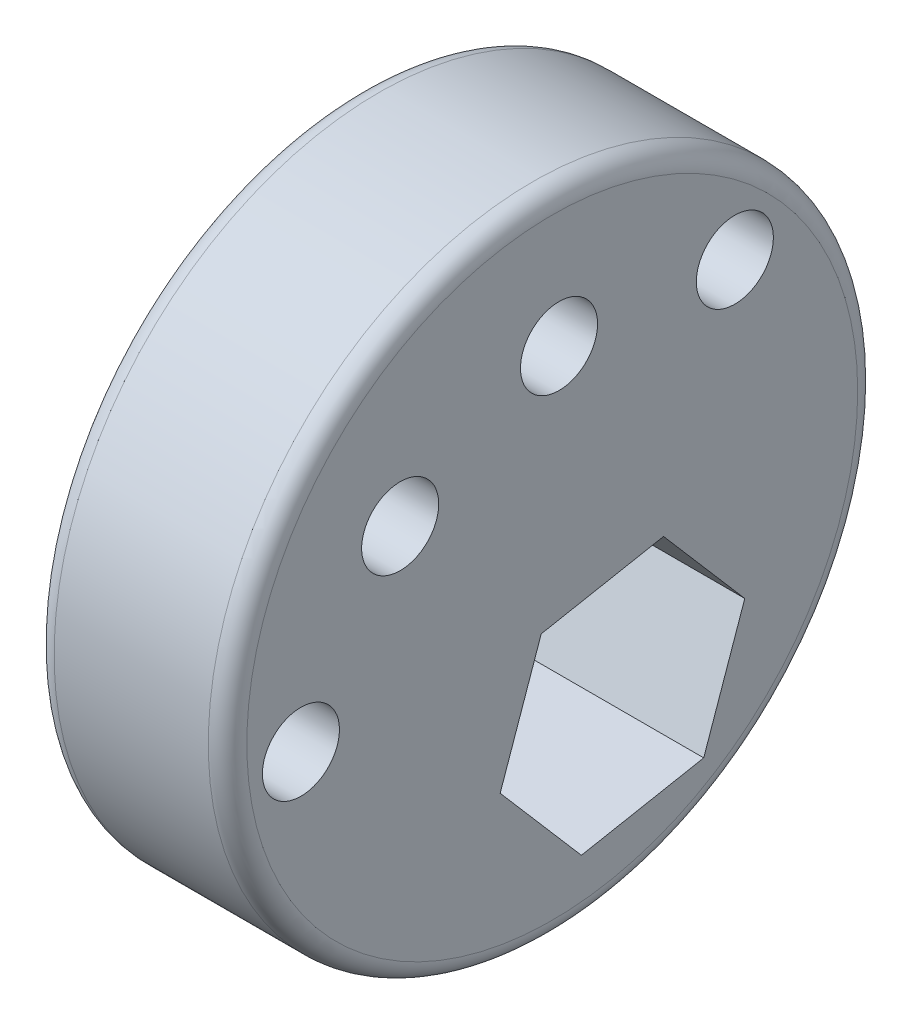
ISO-10303-21;
HEADER;
FILE_DESCRIPTION(('STEP AP214'),'2;1');
FILE_NAME('part.step','',(''),(''),'','','');
FILE_SCHEMA(('AUTOMOTIVE_DESIGN { 1 0 10303 214 1 1 1 1 }'));
ENDSEC;
DATA;
#1=APPLICATION_CONTEXT('core data for automotive mechanical design processes');
#2=APPLICATION_PROTOCOL_DEFINITION('international standard','automotive_design',2000,#1);
#3=PRODUCT_CONTEXT('',#1,'mechanical');
#4=PRODUCT('Part','Part','',(#3));
#5=PRODUCT_RELATED_PRODUCT_CATEGORY('part','',(#4));
#6=PRODUCT_DEFINITION_FORMATION('','',#4);
#7=PRODUCT_DEFINITION_CONTEXT('part definition',#1,'design');
#8=PRODUCT_DEFINITION('design','',#6,#7);
#9=PRODUCT_DEFINITION_SHAPE('','',#8);
#10=(LENGTH_UNIT() NAMED_UNIT(*) SI_UNIT(.MILLI.,.METRE.));
#11=(NAMED_UNIT(*) PLANE_ANGLE_UNIT() SI_UNIT($,.RADIAN.));
#12=(NAMED_UNIT(*) SI_UNIT($,.STERADIAN.) SOLID_ANGLE_UNIT());
#13=UNCERTAINTY_MEASURE_WITH_UNIT(LENGTH_MEASURE(1.E-05),#10,'distance_accuracy_value','');
#14=(GEOMETRIC_REPRESENTATION_CONTEXT(3) GLOBAL_UNCERTAINTY_ASSIGNED_CONTEXT((#13)) GLOBAL_UNIT_ASSIGNED_CONTEXT((#10,
#11,#12)) REPRESENTATION_CONTEXT('',''));
#15=CARTESIAN_POINT('',(0.,0.,0.));
#16=DIRECTION('',(0.,0.,1.));
#17=DIRECTION('',(1.,0.,0.));
#18=AXIS2_PLACEMENT_3D('',#15,#16,#17);
#19=CARTESIAN_POINT('',(5.,0.,0.));
#20=DIRECTION('',(1.,0.,0.));
#21=DIRECTION('',(0.,0.,-1.));
#22=AXIS2_PLACEMENT_3D('',#19,#20,#21);
#23=PLANE('',#22);
#24=CARTESIAN_POINT('',(5.,0.,0.));
#25=DIRECTION('',(1.,0.,0.));
#26=DIRECTION('',(0.,0.,-1.));
#27=AXIS2_PLACEMENT_3D('',#24,#25,#26);
#28=CIRCLE('',#27,7.925);
#29=CARTESIAN_POINT('',(5.,0.,-7.925));
#30=VERTEX_POINT('',#29);
#31=EDGE_CURVE('E128',#30,#30,#28,.T.);
#32=ORIENTED_EDGE('',*,*,#31,.T.);
#33=EDGE_LOOP('',(#32));
#34=FACE_BOUND('',#33,.T.);
#35=CARTESIAN_POINT('',(5.,2.9036531502851,3.94577731481241));
#36=DIRECTION('',(1.,0.,0.));
#37=DIRECTION('',(0.,0.,-1.));
#38=AXIS2_PLACEMENT_3D('',#35,#36,#37);
#39=CIRCLE('',#38,1.);
#40=CARTESIAN_POINT('',(5.,2.9036531502851,2.94577731481241));
#41=VERTEX_POINT('',#40);
#42=EDGE_CURVE('E213',#41,#41,#39,.T.);
#43=ORIENTED_EDGE('',*,*,#42,.F.);
#44=EDGE_LOOP('',(#43));
#45=FACE_BOUND('',#44,.T.);
#46=CARTESIAN_POINT('',(5.,4.55040375200198,-4.73716011742074));
#47=DIRECTION('',(1.,0.,0.));
#48=DIRECTION('',(0.,0.,-1.));
#49=AXIS2_PLACEMENT_3D('',#46,#47,#48);
#50=CIRCLE('',#49,1.);
#51=CARTESIAN_POINT('',(5.,4.55040375200198,-5.73716011742074));
#52=VERTEX_POINT('',#51);
#53=EDGE_CURVE('E127',#52,#52,#50,.T.);
#54=ORIENTED_EDGE('',*,*,#53,.F.);
#55=EDGE_LOOP('',(#54));
#56=FACE_BOUND('',#55,.T.);
#57=DIRECTION('',(0.,-0.757692435093475,-0.652611809425879));
#58=VECTOR('',#57,1.);
#59=CARTESIAN_POINT('',(5.,-6.84181547796235,-0.756323030851715));
#60=LINE('',#59,#58);
#61=CARTESIAN_POINT('',(5.,-4.39446891261044,1.35161311359386));
#62=VERTEX_POINT('',#61);
#63=CARTESIAN_POINT('',(5.,-6.84181547796235,-0.756323030851715));
#64=VERTEX_POINT('',#63);
#65=EDGE_CURVE('E90',#62,#64,#60,.T.);
#66=ORIENTED_EDGE('',*,*,#65,.F.);
#67=DIRECTION('',(0.,-0.944024623319282,0.329874992333289));
#68=VECTOR('',#67,1.);
#69=CARTESIAN_POINT('',(5.,-4.39446891261044,1.35161311359386));
#70=LINE('',#69,#68);
#71=CARTESIAN_POINT('',(5.,-1.34526937928919,0.286116888357352));
#72=VERTEX_POINT('',#71);
#73=EDGE_CURVE('E96',#72,#62,#70,.T.);
#74=ORIENTED_EDGE('',*,*,#73,.F.);
#75=DIRECTION('',(0.,-0.186332188225824,0.982486801759177));
#76=VECTOR('',#75,1.);
#77=CARTESIAN_POINT('',(5.,-1.34526937928919,0.286116888357352));
#78=LINE('',#77,#76);
#79=CARTESIAN_POINT('',(5.,-0.743416411319781,-2.8873154813248));
#80=VERTEX_POINT('',#79);
#81=EDGE_CURVE('E102',#80,#72,#78,.T.);
#82=ORIENTED_EDGE('',*,*,#81,.F.);
#83=DIRECTION('',(0.,0.757692435093471,0.652611809425885));
#84=VECTOR('',#83,1.);
#85=CARTESIAN_POINT('',(5.,-0.743416411319781,-2.8873154813248));
#86=LINE('',#85,#84);
#87=CARTESIAN_POINT('',(5.,-3.19076297667172,-4.99525162577044));
#88=VERTEX_POINT('',#87);
#89=EDGE_CURVE('E48',#88,#80,#86,.T.);
#90=ORIENTED_EDGE('',*,*,#89,.F.);
#91=DIRECTION('',(0.,0.944024623319279,-0.329874992333299));
#92=VECTOR('',#91,1.);
#93=CARTESIAN_POINT('',(5.,-3.19076297667172,-4.99525162577044));
#94=LINE('',#93,#92);
#95=CARTESIAN_POINT('',(5.,-6.239962509993,-3.92975540053388));
#96=VERTEX_POINT('',#95);
#97=EDGE_CURVE('E109',#96,#88,#94,.T.);
#98=ORIENTED_EDGE('',*,*,#97,.F.);
#99=DIRECTION('',(0.,0.186332188225804,-0.982486801759181));
#100=VECTOR('',#99,1.);
#101=CARTESIAN_POINT('',(5.,-6.239962509993,-3.92975540053388));
#102=LINE('',#101,#100);
#103=EDGE_CURVE('E107',#64,#96,#102,.T.);
#104=ORIENTED_EDGE('',*,*,#103,.F.);
#105=EDGE_LOOP('',(#66,#74,#82,#90,#98,#104));
#106=FACE_BOUND('',#105,.T.);
#107=CARTESIAN_POINT('',(5.,4.89032148759197,-0.175068654371388));
#108=DIRECTION('',(1.,0.,0.));
#109=DIRECTION('',(0.,0.,-1.));
#110=AXIS2_PLACEMENT_3D('',#107,#108,#109);
#111=CIRCLE('',#110,1.);
#112=CARTESIAN_POINT('',(5.,4.89032148759197,-1.17506865437139));
#113=VERTEX_POINT('',#112);
#114=EDGE_CURVE('E222',#113,#113,#111,.T.);
#115=ORIENTED_EDGE('',*,*,#114,.F.);
#116=EDGE_LOOP('',(#115));
#117=FACE_BOUND('',#116,.T.);
#118=CARTESIAN_POINT('',(5.,-0.877275083308671,6.52120044055481));
#119=DIRECTION('',(1.,0.,0.));
#120=DIRECTION('',(0.,0.,-1.));
#121=AXIS2_PLACEMENT_3D('',#118,#119,#120);
#122=CIRCLE('',#121,1.);
#123=CARTESIAN_POINT('',(5.,-0.877275083308671,5.52120044055481));
#124=VERTEX_POINT('',#123);
#125=EDGE_CURVE('E208',#124,#124,#122,.T.);
#126=ORIENTED_EDGE('',*,*,#125,.F.);
#127=EDGE_LOOP('',(#126));
#128=FACE_BOUND('',#127,.T.);
#129=ADVANCED_FACE('F33',(#34,#45,#56,#106,#117,#128),#23,.T.);
#130=CARTESIAN_POINT('',(0.,0.,0.));
#131=DIRECTION('',(1.,0.,0.));
#132=DIRECTION('',(0.,0.,-1.));
#133=AXIS2_PLACEMENT_3D('',#130,#131,#132);
#134=PLANE('',#133);
#135=CARTESIAN_POINT('',(0.,0.,0.));
#136=DIRECTION('',(1.,0.,0.));
#137=DIRECTION('',(0.,0.,-1.));
#138=AXIS2_PLACEMENT_3D('',#135,#136,#137);
#139=CIRCLE('',#138,7.925);
#140=CARTESIAN_POINT('',(0.,0.,-7.925));
#141=VERTEX_POINT('',#140);
#142=EDGE_CURVE('E11',#141,#141,#139,.F.);
#143=ORIENTED_EDGE('',*,*,#142,.T.);
#144=EDGE_LOOP('',(#143));
#145=FACE_BOUND('',#144,.T.);
#146=CARTESIAN_POINT('',(0.,2.9036531502851,3.94577731481241));
#147=DIRECTION('',(1.,0.,0.));
#148=DIRECTION('',(0.,0.,-1.));
#149=AXIS2_PLACEMENT_3D('',#146,#147,#148);
#150=CIRCLE('',#149,1.);
#151=CARTESIAN_POINT('',(0.,2.9036531502851,2.94577731481241));
#152=VERTEX_POINT('',#151);
#153=EDGE_CURVE('E210',#152,#152,#150,.T.);
#154=ORIENTED_EDGE('',*,*,#153,.T.);
#155=EDGE_LOOP('',(#154));
#156=FACE_BOUND('',#155,.T.);
#157=CARTESIAN_POINT('',(0.,4.55040375200198,-4.73716011742074));
#158=DIRECTION('',(1.,0.,0.));
#159=DIRECTION('',(0.,0.,-1.));
#160=AXIS2_PLACEMENT_3D('',#157,#158,#159);
#161=CIRCLE('',#160,1.);
#162=CARTESIAN_POINT('',(0.,4.55040375200198,-5.73716011742074));
#163=VERTEX_POINT('',#162);
#164=EDGE_CURVE('E225',#163,#163,#161,.T.);
#165=ORIENTED_EDGE('',*,*,#164,.T.);
#166=EDGE_LOOP('',(#165));
#167=FACE_BOUND('',#166,.T.);
#168=DIRECTION('',(0.,-0.944024623319282,0.329874992333289));
#169=VECTOR('',#168,1.);
#170=CARTESIAN_POINT('',(0.,-4.39446891261044,1.35161311359386));
#171=LINE('',#170,#169);
#172=CARTESIAN_POINT('',(0.,-1.34526937928919,0.286116888357352));
#173=VERTEX_POINT('',#172);
#174=CARTESIAN_POINT('',(0.,-4.39446891261044,1.35161311359386));
#175=VERTEX_POINT('',#174);
#176=EDGE_CURVE('E56',#173,#175,#171,.T.);
#177=ORIENTED_EDGE('',*,*,#176,.T.);
#178=DIRECTION('',(0.,-0.757692435093475,-0.652611809425879));
#179=VECTOR('',#178,1.);
#180=CARTESIAN_POINT('',(0.,-6.84181547796235,-0.756323030851715));
#181=LINE('',#180,#179);
#182=CARTESIAN_POINT('',(0.,-6.84181547796235,-0.756323030851715));
#183=VERTEX_POINT('',#182);
#184=EDGE_CURVE('E93',#175,#183,#181,.T.);
#185=ORIENTED_EDGE('',*,*,#184,.T.);
#186=DIRECTION('',(0.,0.186332188225804,-0.982486801759181));
#187=VECTOR('',#186,1.);
#188=CARTESIAN_POINT('',(0.,-6.239962509993,-3.92975540053388));
#189=LINE('',#188,#187);
#190=CARTESIAN_POINT('',(0.,-6.239962509993,-3.92975540053388));
#191=VERTEX_POINT('',#190);
#192=EDGE_CURVE('E117',#183,#191,#189,.T.);
#193=ORIENTED_EDGE('',*,*,#192,.T.);
#194=DIRECTION('',(0.,0.944024623319278,-0.329874992333299));
#195=VECTOR('',#194,1.);
#196=CARTESIAN_POINT('',(0.,-3.19076297667172,-4.99525162577044));
#197=LINE('',#196,#195);
#198=CARTESIAN_POINT('',(0.,-3.19076297667172,-4.99525162577044));
#199=VERTEX_POINT('',#198);
#200=EDGE_CURVE('E120',#191,#199,#197,.T.);
#201=ORIENTED_EDGE('',*,*,#200,.T.);
#202=DIRECTION('',(0.,0.75769243509347,0.652611809425885));
#203=VECTOR('',#202,1.);
#204=CARTESIAN_POINT('',(0.,-0.743416411319781,-2.8873154813248));
#205=LINE('',#204,#203);
#206=CARTESIAN_POINT('',(0.,-0.743416411319781,-2.8873154813248));
#207=VERTEX_POINT('',#206);
#208=EDGE_CURVE('E123',#199,#207,#205,.T.);
#209=ORIENTED_EDGE('',*,*,#208,.T.);
#210=DIRECTION('',(0.,-0.186332188225824,0.982486801759177));
#211=VECTOR('',#210,1.);
#212=CARTESIAN_POINT('',(0.,-1.34526937928919,0.286116888357352));
#213=LINE('',#212,#211);
#214=EDGE_CURVE('E113',#207,#173,#213,.T.);
#215=ORIENTED_EDGE('',*,*,#214,.T.);
#216=EDGE_LOOP('',(#177,#185,#193,#201,#209,#215));
#217=FACE_BOUND('',#216,.T.);
#218=CARTESIAN_POINT('',(0.,4.89032148759197,-0.175068654371388));
#219=DIRECTION('',(1.,0.,0.));
#220=DIRECTION('',(0.,0.,-1.));
#221=AXIS2_PLACEMENT_3D('',#218,#219,#220);
#222=CIRCLE('',#221,1.);
#223=CARTESIAN_POINT('',(0.,4.89032148759197,-1.17506865437139));
#224=VERTEX_POINT('',#223);
#225=EDGE_CURVE('E219',#224,#224,#222,.T.);
#226=ORIENTED_EDGE('',*,*,#225,.T.);
#227=EDGE_LOOP('',(#226));
#228=FACE_BOUND('',#227,.T.);
#229=CARTESIAN_POINT('',(0.,-0.877275083308671,6.52120044055481));
#230=DIRECTION('',(1.,0.,0.));
#231=DIRECTION('',(0.,0.,-1.));
#232=AXIS2_PLACEMENT_3D('',#229,#230,#231);
#233=CIRCLE('',#232,1.);
#234=CARTESIAN_POINT('',(0.,-0.877275083308671,5.52120044055481));
#235=VERTEX_POINT('',#234);
#236=EDGE_CURVE('E205',#235,#235,#233,.T.);
#237=ORIENTED_EDGE('',*,*,#236,.T.);
#238=EDGE_LOOP('',(#237));
#239=FACE_BOUND('',#238,.T.);
#240=ADVANCED_FACE('F149',(#145,#156,#167,#217,#228,#239),#134,.F.);
#241=CARTESIAN_POINT('',(5.,0.,0.));
#242=DIRECTION('',(-1.,0.,0.));
#243=DIRECTION('',(0.,0.,1.));
#244=AXIS2_PLACEMENT_3D('',#241,#242,#243);
#245=CYLINDRICAL_SURFACE('',#244,8.425);
#246=CARTESIAN_POINT('',(0.5,0.,0.));
#247=DIRECTION('',(1.,0.,0.));
#248=DIRECTION('',(0.,0.,-1.));
#249=AXIS2_PLACEMENT_3D('',#246,#247,#248);
#250=CIRCLE('',#249,8.425);
#251=CARTESIAN_POINT('',(0.5,0.,-8.425));
#252=VERTEX_POINT('',#251);
#253=EDGE_CURVE('E41',#252,#252,#250,.T.);
#254=ORIENTED_EDGE('',*,*,#253,.T.);
#255=EDGE_LOOP('',(#254));
#256=FACE_BOUND('',#255,.T.);
#257=CARTESIAN_POINT('',(4.5,0.,0.));
#258=DIRECTION('',(1.,0.,0.));
#259=DIRECTION('',(0.,0.,-1.));
#260=AXIS2_PLACEMENT_3D('',#257,#258,#259);
#261=CIRCLE('',#260,8.425);
#262=CARTESIAN_POINT('',(4.5,0.,-8.425));
#263=VERTEX_POINT('',#262);
#264=EDGE_CURVE('E131',#263,#263,#261,.F.);
#265=ORIENTED_EDGE('',*,*,#264,.T.);
#266=EDGE_LOOP('',(#265));
#267=FACE_BOUND('',#266,.T.);
#268=ADVANCED_FACE('F136',(#256,#267),#245,.T.);
#269=CARTESIAN_POINT('',(13.8018840708006,-4.39446891261044,1.35161311359386));
#270=DIRECTION('',(0.,-0.329874992333289,-0.944024623319282));
#271=DIRECTION('',(0.,0.944024623319282,-0.329874992333289));
#272=AXIS2_PLACEMENT_3D('',#269,#270,#271);
#273=PLANE('',#272);
#274=ORIENTED_EDGE('',*,*,#73,.T.);
#275=DIRECTION('',(-1.,0.,0.));
#276=VECTOR('',#275,1.);
#277=CARTESIAN_POINT('',(13.8018840708006,-4.39446891261044,1.35161311359386));
#278=LINE('',#277,#276);
#279=EDGE_CURVE('E86',#62,#175,#278,.T.);
#280=ORIENTED_EDGE('',*,*,#279,.T.);
#281=ORIENTED_EDGE('',*,*,#176,.F.);
#282=DIRECTION('',(-1.,0.,0.));
#283=VECTOR('',#282,1.);
#284=CARTESIAN_POINT('',(13.8018840708006,-1.34526937928919,0.286116888357352));
#285=LINE('',#284,#283);
#286=EDGE_CURVE('E98',#72,#173,#285,.T.);
#287=ORIENTED_EDGE('',*,*,#286,.F.);
#288=EDGE_LOOP('',(#274,#280,#281,#287));
#289=FACE_BOUND('',#288,.T.);
#290=ADVANCED_FACE('F97',(#289),#273,.T.);
#291=CARTESIAN_POINT('',(13.8018840708006,-6.84181547796235,-0.756323030851715));
#292=DIRECTION('',(0.,0.652611809425879,-0.757692435093475));
#293=DIRECTION('',(0.,0.757692435093475,0.652611809425879));
#294=AXIS2_PLACEMENT_3D('',#291,#292,#293);
#295=PLANE('',#294);
#296=ORIENTED_EDGE('',*,*,#65,.T.);
#297=DIRECTION('',(-1.,0.,0.));
#298=VECTOR('',#297,1.);
#299=CARTESIAN_POINT('',(13.8018840708006,-6.84181547796235,-0.756323030851715));
#300=LINE('',#299,#298);
#301=EDGE_CURVE('E115',#64,#183,#300,.T.);
#302=ORIENTED_EDGE('',*,*,#301,.T.);
#303=ORIENTED_EDGE('',*,*,#184,.F.);
#304=ORIENTED_EDGE('',*,*,#279,.F.);
#305=EDGE_LOOP('',(#296,#302,#303,#304));
#306=FACE_BOUND('',#305,.T.);
#307=ADVANCED_FACE('F88',(#306),#295,.T.);
#308=CARTESIAN_POINT('',(13.8018840708006,-6.239962509993,-3.92975540053388));
#309=DIRECTION('',(0.,0.98248680175918,0.186332188225804));
#310=DIRECTION('',(0.,-0.186332188225804,0.982486801759181));
#311=AXIS2_PLACEMENT_3D('',#308,#309,#310);
#312=PLANE('',#311);
#313=ORIENTED_EDGE('',*,*,#103,.T.);
#314=DIRECTION('',(-1.,0.,0.));
#315=VECTOR('',#314,1.);
#316=CARTESIAN_POINT('',(13.8018840708006,-6.239962509993,-3.92975540053388));
#317=LINE('',#316,#315);
#318=EDGE_CURVE('E118',#96,#191,#317,.T.);
#319=ORIENTED_EDGE('',*,*,#318,.T.);
#320=ORIENTED_EDGE('',*,*,#192,.F.);
#321=ORIENTED_EDGE('',*,*,#301,.F.);
#322=EDGE_LOOP('',(#313,#319,#320,#321));
#323=FACE_BOUND('',#322,.T.);
#324=ADVANCED_FACE('F168',(#323),#312,.T.);
#325=CARTESIAN_POINT('',(13.8018840708006,-3.19076297667172,-4.99525162577044));
#326=DIRECTION('',(0.,0.329874992333299,0.944024623319278));
#327=DIRECTION('',(0.,-0.944024623319279,0.329874992333299));
#328=AXIS2_PLACEMENT_3D('',#325,#326,#327);
#329=PLANE('',#328);
#330=ORIENTED_EDGE('',*,*,#97,.T.);
#331=DIRECTION('',(-1.,0.,0.));
#332=VECTOR('',#331,1.);
#333=CARTESIAN_POINT('',(13.8018840708006,-3.19076297667172,-4.99525162577044));
#334=LINE('',#333,#332);
#335=EDGE_CURVE('E121',#88,#199,#334,.T.);
#336=ORIENTED_EDGE('',*,*,#335,.T.);
#337=ORIENTED_EDGE('',*,*,#200,.F.);
#338=ORIENTED_EDGE('',*,*,#318,.F.);
#339=EDGE_LOOP('',(#330,#336,#337,#338));
#340=FACE_BOUND('',#339,.T.);
#341=ADVANCED_FACE('F172',(#340),#329,.T.);
#342=CARTESIAN_POINT('',(13.8018840708006,-0.743416411319781,-2.8873154813248));
#343=DIRECTION('',(0.,-0.652611809425885,0.75769243509347));
#344=DIRECTION('',(0.,-0.757692435093471,-0.652611809425885));
#345=AXIS2_PLACEMENT_3D('',#342,#343,#344);
#346=PLANE('',#345);
#347=ORIENTED_EDGE('',*,*,#89,.T.);
#348=DIRECTION('',(-1.,0.,0.));
#349=VECTOR('',#348,1.);
#350=CARTESIAN_POINT('',(13.8018840708006,-0.743416411319781,-2.8873154813248));
#351=LINE('',#350,#349);
#352=EDGE_CURVE('E124',#80,#207,#351,.T.);
#353=ORIENTED_EDGE('',*,*,#352,.T.);
#354=ORIENTED_EDGE('',*,*,#208,.F.);
#355=ORIENTED_EDGE('',*,*,#335,.F.);
#356=EDGE_LOOP('',(#347,#353,#354,#355));
#357=FACE_BOUND('',#356,.T.);
#358=ADVANCED_FACE('F178',(#357),#346,.T.);
#359=CARTESIAN_POINT('',(13.8018840708006,-1.34526937928919,0.286116888357352));
#360=DIRECTION('',(0.,-0.982486801759177,-0.186332188225824));
#361=DIRECTION('',(0.,0.186332188225824,-0.982486801759177));
#362=AXIS2_PLACEMENT_3D('',#359,#360,#361);
#363=PLANE('',#362);
#364=ORIENTED_EDGE('',*,*,#81,.T.);
#365=ORIENTED_EDGE('',*,*,#286,.T.);
#366=ORIENTED_EDGE('',*,*,#214,.F.);
#367=ORIENTED_EDGE('',*,*,#352,.F.);
#368=EDGE_LOOP('',(#364,#365,#366,#367));
#369=FACE_BOUND('',#368,.T.);
#370=ADVANCED_FACE('F182',(#369),#363,.T.);
#371=CARTESIAN_POINT('',(13.8018840708006,4.55040375200198,-4.73716011742074));
#372=DIRECTION('',(-1.,0.,0.));
#373=DIRECTION('',(0.,0.,1.));
#374=AXIS2_PLACEMENT_3D('',#371,#372,#373);
#375=CYLINDRICAL_SURFACE('',#374,1.);
#376=ORIENTED_EDGE('',*,*,#164,.F.);
#377=EDGE_LOOP('',(#376));
#378=FACE_BOUND('',#377,.T.);
#379=ORIENTED_EDGE('',*,*,#53,.T.);
#380=EDGE_LOOP('',(#379));
#381=FACE_BOUND('',#380,.T.);
#382=ADVANCED_FACE('F185',(#378,#381),#375,.F.);
#383=CARTESIAN_POINT('',(13.8018840708006,4.89032148759197,-0.175068654371388));
#384=DIRECTION('',(-1.,0.,0.));
#385=DIRECTION('',(0.,0.,1.));
#386=AXIS2_PLACEMENT_3D('',#383,#384,#385);
#387=CYLINDRICAL_SURFACE('',#386,1.);
#388=ORIENTED_EDGE('',*,*,#225,.F.);
#389=EDGE_LOOP('',(#388));
#390=FACE_BOUND('',#389,.T.);
#391=ORIENTED_EDGE('',*,*,#114,.T.);
#392=EDGE_LOOP('',(#391));
#393=FACE_BOUND('',#392,.T.);
#394=ADVANCED_FACE('F189',(#390,#393),#387,.F.);
#395=CARTESIAN_POINT('',(13.8018840708006,2.9036531502851,3.94577731481241));
#396=DIRECTION('',(-1.,0.,0.));
#397=DIRECTION('',(0.,0.,1.));
#398=AXIS2_PLACEMENT_3D('',#395,#396,#397);
#399=CYLINDRICAL_SURFACE('',#398,1.);
#400=ORIENTED_EDGE('',*,*,#153,.F.);
#401=EDGE_LOOP('',(#400));
#402=FACE_BOUND('',#401,.T.);
#403=ORIENTED_EDGE('',*,*,#42,.T.);
#404=EDGE_LOOP('',(#403));
#405=FACE_BOUND('',#404,.T.);
#406=ADVANCED_FACE('F193',(#402,#405),#399,.F.);
#407=CARTESIAN_POINT('',(13.8018840708006,-0.877275083308671,6.52120044055481));
#408=DIRECTION('',(-1.,0.,0.));
#409=DIRECTION('',(0.,0.,1.));
#410=AXIS2_PLACEMENT_3D('',#407,#408,#409);
#411=CYLINDRICAL_SURFACE('',#410,1.);
#412=ORIENTED_EDGE('',*,*,#236,.F.);
#413=EDGE_LOOP('',(#412));
#414=FACE_BOUND('',#413,.T.);
#415=ORIENTED_EDGE('',*,*,#125,.T.);
#416=EDGE_LOOP('',(#415));
#417=FACE_BOUND('',#416,.T.);
#418=ADVANCED_FACE('F145',(#414,#417),#411,.F.);
#419=CARTESIAN_POINT('',(4.5,0.,0.));
#420=DIRECTION('',(1.,0.,0.));
#421=DIRECTION('',(0.,0.,-1.));
#422=AXIS2_PLACEMENT_3D('',#419,#420,#421);
#423=TOROIDAL_SURFACE('',#422,7.925,0.5);
#424=ORIENTED_EDGE('',*,*,#264,.F.);
#425=EDGE_LOOP('',(#424));
#426=FACE_BOUND('',#425,.T.);
#427=ORIENTED_EDGE('',*,*,#31,.F.);
#428=EDGE_LOOP('',(#427));
#429=FACE_BOUND('',#428,.T.);
#430=ADVANCED_FACE('F140',(#426,#429),#423,.T.);
#431=CARTESIAN_POINT('',(0.5,0.,0.));
#432=DIRECTION('',(1.,0.,0.));
#433=DIRECTION('',(0.,0.,-1.));
#434=AXIS2_PLACEMENT_3D('',#431,#432,#433);
#435=TOROIDAL_SURFACE('',#434,7.925,0.5);
#436=ORIENTED_EDGE('',*,*,#142,.F.);
#437=EDGE_LOOP('',(#436));
#438=FACE_BOUND('',#437,.T.);
#439=ORIENTED_EDGE('',*,*,#253,.F.);
#440=EDGE_LOOP('',(#439));
#441=FACE_BOUND('',#440,.T.);
#442=ADVANCED_FACE('F35',(#438,#441),#435,.T.);
#443=CLOSED_SHELL('',(#129,#240,#268,#290,#307,#324,#341,#358,#370,#382,#394,#406,#418,#430,#442));
#444=MANIFOLD_SOLID_BREP('B2',#443);
#445=ADVANCED_BREP_SHAPE_REPRESENTATION('',(#18,#444),#14);
#446=SHAPE_DEFINITION_REPRESENTATION(#9,#445);
ENDSEC;
END-ISO-10303-21;
